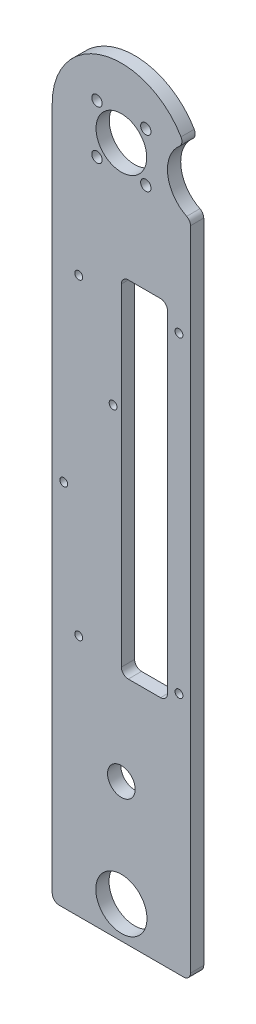
ISO-10303-21;
HEADER;
FILE_DESCRIPTION(('STEP AP214'),'2;1');
FILE_NAME('part.step','',(''),(''),'','','');
FILE_SCHEMA(('AUTOMOTIVE_DESIGN { 1 0 10303 214 1 1 1 1 }'));
ENDSEC;
DATA;
#1=APPLICATION_CONTEXT('core data for automotive mechanical design processes');
#2=APPLICATION_PROTOCOL_DEFINITION('international standard','automotive_design',2000,#1);
#3=PRODUCT_CONTEXT('',#1,'mechanical');
#4=PRODUCT('Part','Part','',(#3));
#5=PRODUCT_RELATED_PRODUCT_CATEGORY('part','',(#4));
#6=PRODUCT_DEFINITION_FORMATION('','',#4);
#7=PRODUCT_DEFINITION_CONTEXT('part definition',#1,'design');
#8=PRODUCT_DEFINITION('design','',#6,#7);
#9=PRODUCT_DEFINITION_SHAPE('','',#8);
#10=(LENGTH_UNIT() NAMED_UNIT(*) SI_UNIT(.MILLI.,.METRE.));
#11=(NAMED_UNIT(*) PLANE_ANGLE_UNIT() SI_UNIT($,.RADIAN.));
#12=(NAMED_UNIT(*) SI_UNIT($,.STERADIAN.) SOLID_ANGLE_UNIT());
#13=UNCERTAINTY_MEASURE_WITH_UNIT(LENGTH_MEASURE(1.E-05),#10,'distance_accuracy_value','');
#14=(GEOMETRIC_REPRESENTATION_CONTEXT(3) GLOBAL_UNCERTAINTY_ASSIGNED_CONTEXT((#13)) GLOBAL_UNIT_ASSIGNED_CONTEXT((#10,
#11,#12)) REPRESENTATION_CONTEXT('',''));
#15=CARTESIAN_POINT('',(0.,0.,0.));
#16=DIRECTION('',(0.,0.,1.));
#17=DIRECTION('',(1.,0.,0.));
#18=AXIS2_PLACEMENT_3D('',#15,#16,#17);
#19=CARTESIAN_POINT('',(60.,0.,5.74999999999996));
#20=DIRECTION('',(0.,0.,-1.));
#21=DIRECTION('',(0.,1.,0.));
#22=AXIS2_PLACEMENT_3D('',#19,#20,#21);
#23=PLANE('',#22);
#24=CARTESIAN_POINT('',(11.50000102,240.99999992,5.74999999999998));
#25=DIRECTION('',(0.,0.,-1.));
#26=DIRECTION('',(0.,1.,0.));
#27=AXIS2_PLACEMENT_3D('',#24,#25,#26);
#28=CIRCLE('',#27,1.7);
#29=CARTESIAN_POINT('',(11.50000102,242.69999992,5.74999999999998));
#30=VERTEX_POINT('',#29);
#31=EDGE_CURVE('E580',#30,#30,#28,.T.);
#32=ORIENTED_EDGE('',*,*,#31,.T.);
#33=EDGE_LOOP('',(#32));
#34=FACE_BOUND('',#33,.T.);
#35=CARTESIAN_POINT('',(55.00000038,240.99999992,5.74999999999998));
#36=DIRECTION('',(0.,0.,-1.));
#37=DIRECTION('',(0.,1.,0.));
#38=AXIS2_PLACEMENT_3D('',#35,#36,#37);
#39=CIRCLE('',#38,1.7);
#40=CARTESIAN_POINT('',(55.00000038,242.69999992,5.74999999999998));
#41=VERTEX_POINT('',#40);
#42=EDGE_CURVE('E593',#41,#41,#39,.T.);
#43=ORIENTED_EDGE('',*,*,#42,.T.);
#44=EDGE_LOOP('',(#43));
#45=FACE_BOUND('',#44,.T.);
#46=CARTESIAN_POINT('',(11.50000102,105.49999914,5.74999999999997));
#47=DIRECTION('',(0.,0.,-1.));
#48=DIRECTION('',(0.,1.,0.));
#49=AXIS2_PLACEMENT_3D('',#46,#47,#48);
#50=CIRCLE('',#49,1.7);
#51=CARTESIAN_POINT('',(11.50000102,107.19999914,5.74999999999997));
#52=VERTEX_POINT('',#51);
#53=EDGE_CURVE('E601',#52,#52,#50,.T.);
#54=ORIENTED_EDGE('',*,*,#53,.T.);
#55=EDGE_LOOP('',(#54));
#56=FACE_BOUND('',#55,.T.);
#57=CARTESIAN_POINT('',(55.00000038,105.49999914,5.74999999999997));
#58=DIRECTION('',(0.,0.,-1.));
#59=DIRECTION('',(0.,1.,0.));
#60=AXIS2_PLACEMENT_3D('',#57,#58,#59);
#61=CIRCLE('',#60,1.7);
#62=CARTESIAN_POINT('',(55.00000038,107.19999914,5.74999999999997));
#63=VERTEX_POINT('',#62);
#64=EDGE_CURVE('E609',#63,#63,#61,.T.);
#65=ORIENTED_EDGE('',*,*,#64,.T.);
#66=EDGE_LOOP('',(#65));
#67=FACE_BOUND('',#66,.T.);
#68=CARTESIAN_POINT('',(5.,160.,5.74999999999997));
#69=DIRECTION('',(0.,0.,-1.));
#70=DIRECTION('',(0.,1.,0.));
#71=AXIS2_PLACEMENT_3D('',#68,#69,#70);
#72=CIRCLE('',#71,1.7);
#73=CARTESIAN_POINT('',(5.,161.7,5.74999999999997));
#74=VERTEX_POINT('',#73);
#75=EDGE_CURVE('E617',#74,#74,#72,.T.);
#76=ORIENTED_EDGE('',*,*,#75,.T.);
#77=EDGE_LOOP('',(#76));
#78=FACE_BOUND('',#77,.T.);
#79=CARTESIAN_POINT('',(26.4,199.7,5.74999999999997));
#80=DIRECTION('',(0.,0.,-1.));
#81=DIRECTION('',(0.,1.,0.));
#82=AXIS2_PLACEMENT_3D('',#79,#80,#81);
#83=CIRCLE('',#82,1.7);
#84=CARTESIAN_POINT('',(26.4,201.4,5.74999999999997));
#85=VERTEX_POINT('',#84);
#86=EDGE_CURVE('E625',#85,#85,#83,.T.);
#87=ORIENTED_EDGE('',*,*,#86,.T.);
#88=EDGE_LOOP('',(#87));
#89=FACE_BOUND('',#88,.T.);
#90=CARTESIAN_POINT('',(30.,60.,5.74999999999995));
#91=DIRECTION('',(0.,0.,-1.));
#92=DIRECTION('',(0.,1.,0.));
#93=AXIS2_PLACEMENT_3D('',#90,#91,#92);
#94=CIRCLE('',#93,6.);
#95=CARTESIAN_POINT('',(30.,66.,5.74999999999995));
#96=VERTEX_POINT('',#95);
#97=EDGE_CURVE('E472',#96,#96,#94,.F.);
#98=ORIENTED_EDGE('',*,*,#97,.F.);
#99=EDGE_LOOP('',(#98));
#100=FACE_BOUND('',#99,.T.);
#101=DIRECTION('',(-1.,0.,0.));
#102=VECTOR('',#101,1.);
#103=CARTESIAN_POINT('',(50.0000000000001,250.,5.74999999999995));
#104=LINE('',#103,#102);
#105=CARTESIAN_POINT('',(47.0000000000001,250.,5.74999999999995));
#106=VERTEX_POINT('',#105);
#107=CARTESIAN_POINT('',(33.0000000000001,250.,5.74999999999995));
#108=VERTEX_POINT('',#107);
#109=EDGE_CURVE('E371',#106,#108,#104,.T.);
#110=ORIENTED_EDGE('',*,*,#109,.F.);
#111=CARTESIAN_POINT('',(47.0000000000001,247.,5.74999999999995));
#112=DIRECTION('',(0.,0.,-1.));
#113=DIRECTION('',(0.,1.,0.));
#114=AXIS2_PLACEMENT_3D('',#111,#112,#113);
#115=CIRCLE('',#114,3.);
#116=CARTESIAN_POINT('',(50.0000000000001,247.,5.74999999999995));
#117=VERTEX_POINT('',#116);
#118=EDGE_CURVE('E341',#106,#117,#115,.T.);
#119=ORIENTED_EDGE('',*,*,#118,.T.);
#120=DIRECTION('',(0.,1.,0.));
#121=VECTOR('',#120,1.);
#122=CARTESIAN_POINT('',(50.0000000000001,250.,5.74999999999995));
#123=LINE('',#122,#121);
#124=CARTESIAN_POINT('',(50.,103.,5.74999999999995));
#125=VERTEX_POINT('',#124);
#126=EDGE_CURVE('E378',#125,#117,#123,.T.);
#127=ORIENTED_EDGE('',*,*,#126,.F.);
#128=CARTESIAN_POINT('',(47.,103.,5.74999999999995));
#129=DIRECTION('',(0.,0.,-1.));
#130=DIRECTION('',(0.,1.,0.));
#131=AXIS2_PLACEMENT_3D('',#128,#129,#130);
#132=CIRCLE('',#131,3.);
#133=CARTESIAN_POINT('',(47.,100.,5.74999999999995));
#134=VERTEX_POINT('',#133);
#135=EDGE_CURVE('E335',#125,#134,#132,.T.);
#136=ORIENTED_EDGE('',*,*,#135,.T.);
#137=DIRECTION('',(1.,0.,0.));
#138=VECTOR('',#137,1.);
#139=CARTESIAN_POINT('',(50.,100.,5.74999999999995));
#140=LINE('',#139,#138);
#141=CARTESIAN_POINT('',(33.,100.,5.74999999999995));
#142=VERTEX_POINT('',#141);
#143=EDGE_CURVE('E383',#142,#134,#140,.T.);
#144=ORIENTED_EDGE('',*,*,#143,.F.);
#145=CARTESIAN_POINT('',(33.,103.,5.74999999999995));
#146=DIRECTION('',(0.,0.,-1.));
#147=DIRECTION('',(0.,1.,0.));
#148=AXIS2_PLACEMENT_3D('',#145,#146,#147);
#149=CIRCLE('',#148,3.);
#150=CARTESIAN_POINT('',(30.,103.,5.74999999999995));
#151=VERTEX_POINT('',#150);
#152=EDGE_CURVE('E329',#142,#151,#149,.T.);
#153=ORIENTED_EDGE('',*,*,#152,.T.);
#154=DIRECTION('',(0.,-1.,0.));
#155=VECTOR('',#154,1.);
#156=CARTESIAN_POINT('',(30.0000000000001,250.,5.74999999999995));
#157=LINE('',#156,#155);
#158=CARTESIAN_POINT('',(30.0000000000001,247.,5.74999999999995));
#159=VERTEX_POINT('',#158);
#160=EDGE_CURVE('E373',#159,#151,#157,.T.);
#161=ORIENTED_EDGE('',*,*,#160,.F.);
#162=CARTESIAN_POINT('',(33.0000000000001,247.,5.74999999999995));
#163=DIRECTION('',(0.,0.,-1.));
#164=DIRECTION('',(0.,1.,0.));
#165=AXIS2_PLACEMENT_3D('',#162,#163,#164);
#166=CIRCLE('',#165,3.);
#167=EDGE_CURVE('E12',#159,#108,#166,.T.);
#168=ORIENTED_EDGE('',*,*,#167,.T.);
#169=EDGE_LOOP('',(#110,#119,#127,#136,#144,#153,#161,#168));
#170=FACE_BOUND('',#169,.T.);
#171=CARTESIAN_POINT('',(30.,14.,5.74999999999996));
#172=DIRECTION('',(0.,0.,-1.));
#173=DIRECTION('',(0.,1.,0.));
#174=AXIS2_PLACEMENT_3D('',#171,#172,#173);
#175=CIRCLE('',#174,11.1125);
#176=CARTESIAN_POINT('',(30.,25.1125,5.74999999999996));
#177=VERTEX_POINT('',#176);
#178=EDGE_CURVE('E405',#177,#177,#175,.F.);
#179=ORIENTED_EDGE('',*,*,#178,.F.);
#180=EDGE_LOOP('',(#179));
#181=FACE_BOUND('',#180,.T.);
#182=CARTESIAN_POINT('',(19.3933982822018,310.606601717798,5.74999999999996));
#183=DIRECTION('',(0.,0.,1.));
#184=DIRECTION('',(1.,0.,0.));
#185=AXIS2_PLACEMENT_3D('',#182,#183,#184);
#186=CIRCLE('',#185,2.25);
#187=CARTESIAN_POINT('',(21.6433982822018,310.606601717798,5.74999999999996));
#188=VERTEX_POINT('',#187);
#189=EDGE_CURVE('E409',#188,#188,#186,.T.);
#190=ORIENTED_EDGE('',*,*,#189,.F.);
#191=EDGE_LOOP('',(#190));
#192=FACE_BOUND('',#191,.T.);
#193=CARTESIAN_POINT('',(40.6066017177982,289.393398282202,5.74999999999996));
#194=DIRECTION('',(0.,0.,1.));
#195=DIRECTION('',(1.,0.,0.));
#196=AXIS2_PLACEMENT_3D('',#193,#194,#195);
#197=CIRCLE('',#196,2.25);
#198=CARTESIAN_POINT('',(42.8566017177982,289.393398282202,5.74999999999996));
#199=VERTEX_POINT('',#198);
#200=EDGE_CURVE('E425',#199,#199,#197,.T.);
#201=ORIENTED_EDGE('',*,*,#200,.F.);
#202=EDGE_LOOP('',(#201));
#203=FACE_BOUND('',#202,.T.);
#204=CARTESIAN_POINT('',(19.3933982822018,289.393398282202,5.74999999999996));
#205=DIRECTION('',(0.,0.,1.));
#206=DIRECTION('',(1.,0.,0.));
#207=AXIS2_PLACEMENT_3D('',#204,#205,#206);
#208=CIRCLE('',#207,2.25);
#209=CARTESIAN_POINT('',(21.6433982822018,289.393398282202,5.74999999999996));
#210=VERTEX_POINT('',#209);
#211=EDGE_CURVE('E433',#210,#210,#208,.T.);
#212=ORIENTED_EDGE('',*,*,#211,.F.);
#213=EDGE_LOOP('',(#212));
#214=FACE_BOUND('',#213,.T.);
#215=CARTESIAN_POINT('',(30.,300.,5.74999999999996));
#216=DIRECTION('',(0.,0.,1.));
#217=DIRECTION('',(1.,0.,0.));
#218=AXIS2_PLACEMENT_3D('',#215,#216,#217);
#219=CIRCLE('',#218,11.);
#220=CARTESIAN_POINT('',(41.,300.,5.74999999999996));
#221=VERTEX_POINT('',#220);
#222=EDGE_CURVE('E215',#221,#221,#219,.T.);
#223=ORIENTED_EDGE('',*,*,#222,.F.);
#224=EDGE_LOOP('',(#223));
#225=FACE_BOUND('',#224,.T.);
#226=DIRECTION('',(0.,-1.,0.));
#227=VECTOR('',#226,1.);
#228=CARTESIAN_POINT('',(60.,0.,5.74999999999996));
#229=LINE('',#228,#227);
#230=CARTESIAN_POINT('',(60.,283.875484503403,5.74999999999996));
#231=VERTEX_POINT('',#230);
#232=CARTESIAN_POINT('',(60.,3.,5.74999999999996));
#233=VERTEX_POINT('',#232);
#234=EDGE_CURVE('E238',#231,#233,#229,.T.);
#235=ORIENTED_EDGE('',*,*,#234,.F.);
#236=CARTESIAN_POINT('',(57.,283.875484503403,5.74999999999995));
#237=DIRECTION('',(0.,0.,-1.));
#238=DIRECTION('',(0.,1.,0.));
#239=AXIS2_PLACEMENT_3D('',#236,#237,#238);
#240=CIRCLE('',#239,3.);
#241=CARTESIAN_POINT('',(58.3333333333333,286.562903752836,5.74999999999995));
#242=VERTEX_POINT('',#241);
#243=EDGE_CURVE('E284',#231,#242,#240,.F.);
#244=ORIENTED_EDGE('',*,*,#243,.T.);
#245=CARTESIAN_POINT('',(65.,300.,5.74999999999995));
#246=DIRECTION('',(0.,0.,-1.));
#247=DIRECTION('',(0.,1.,0.));
#248=AXIS2_PLACEMENT_3D('',#245,#246,#247);
#249=CIRCLE('',#248,15.);
#250=CARTESIAN_POINT('',(55.2380952380952,311.388819755335,5.74999999999995));
#251=VERTEX_POINT('',#250);
#252=EDGE_CURVE('E392',#251,#242,#249,.F.);
#253=ORIENTED_EDGE('',*,*,#252,.F.);
#254=CARTESIAN_POINT('',(53.2857142857142,313.666583706402,5.74999999999995));
#255=DIRECTION('',(0.,0.,-1.));
#256=DIRECTION('',(0.,1.,0.));
#257=AXIS2_PLACEMENT_3D('',#254,#255,#256);
#258=CIRCLE('',#257,3.);
#259=CARTESIAN_POINT('',(55.8730158730158,315.185093007113,5.74999999999996));
#260=VERTEX_POINT('',#259);
#261=EDGE_CURVE('E210',#251,#260,#258,.F.);
#262=ORIENTED_EDGE('',*,*,#261,.T.);
#263=CARTESIAN_POINT('',(30.,300.,5.74999999999996));
#264=DIRECTION('',(0.,0.,1.));
#265=DIRECTION('',(1.,0.,0.));
#266=AXIS2_PLACEMENT_3D('',#263,#264,#265);
#267=CIRCLE('',#266,30.);
#268=CARTESIAN_POINT('',(0.,300.,5.74999999999996));
#269=VERTEX_POINT('',#268);
#270=EDGE_CURVE('E202',#260,#269,#267,.T.);
#271=ORIENTED_EDGE('',*,*,#270,.T.);
#272=DIRECTION('',(0.,-1.,0.));
#273=VECTOR('',#272,1.);
#274=CARTESIAN_POINT('',(0.,0.,5.74999999999996));
#275=LINE('',#274,#273);
#276=CARTESIAN_POINT('',(0.,3.,5.74999999999996));
#277=VERTEX_POINT('',#276);
#278=EDGE_CURVE('E207',#269,#277,#275,.T.);
#279=ORIENTED_EDGE('',*,*,#278,.T.);
#280=CARTESIAN_POINT('',(3.,3.,5.74999999999996));
#281=DIRECTION('',(0.,0.,-1.));
#282=DIRECTION('',(0.,1.,0.));
#283=AXIS2_PLACEMENT_3D('',#280,#281,#282);
#284=CIRCLE('',#283,3.);
#285=CARTESIAN_POINT('',(3.,0.,5.74999999999996));
#286=VERTEX_POINT('',#285);
#287=EDGE_CURVE('E99',#277,#286,#284,.F.);
#288=ORIENTED_EDGE('',*,*,#287,.T.);
#289=DIRECTION('',(-1.,0.,0.));
#290=VECTOR('',#289,1.);
#291=CARTESIAN_POINT('',(60.,0.,5.74999999999996));
#292=LINE('',#291,#290);
#293=CARTESIAN_POINT('',(57.,0.,5.74999999999996));
#294=VERTEX_POINT('',#293);
#295=EDGE_CURVE('E244',#294,#286,#292,.T.);
#296=ORIENTED_EDGE('',*,*,#295,.F.);
#297=CARTESIAN_POINT('',(57.,3.,5.74999999999996));
#298=DIRECTION('',(0.,0.,-1.));
#299=DIRECTION('',(0.,1.,0.));
#300=AXIS2_PLACEMENT_3D('',#297,#298,#299);
#301=CIRCLE('',#300,3.);
#302=EDGE_CURVE('E279',#294,#233,#301,.F.);
#303=ORIENTED_EDGE('',*,*,#302,.T.);
#304=EDGE_LOOP('',(#235,#244,#253,#262,#271,#279,#288,#296,#303));
#305=FACE_BOUND('',#304,.T.);
#306=CARTESIAN_POINT('',(40.6066017177982,310.606601717798,5.74999999999996));
#307=DIRECTION('',(0.,0.,1.));
#308=DIRECTION('',(1.,0.,0.));
#309=AXIS2_PLACEMENT_3D('',#306,#307,#308);
#310=CIRCLE('',#309,2.25);
#311=CARTESIAN_POINT('',(42.8566017177982,310.606601717798,5.74999999999996));
#312=VERTEX_POINT('',#311);
#313=EDGE_CURVE('E417',#312,#312,#310,.T.);
#314=ORIENTED_EDGE('',*,*,#313,.F.);
#315=EDGE_LOOP('',(#314));
#316=FACE_BOUND('',#315,.T.);
#317=ADVANCED_FACE('F83',(#34,#45,#56,#67,#78,#89,#100,#170,#181,#192,#203,#214,#225,#305,#316),
#23,.F.);
#318=CARTESIAN_POINT('',(60.,330.,0.));
#319=DIRECTION('',(0.,0.,1.));
#320=DIRECTION('',(0.,-1.,0.));
#321=AXIS2_PLACEMENT_3D('',#318,#319,#320);
#322=PLANE('',#321);
#323=CARTESIAN_POINT('',(11.50000102,240.99999992,0.));
#324=DIRECTION('',(0.,0.,-1.));
#325=DIRECTION('',(0.,1.,0.));
#326=AXIS2_PLACEMENT_3D('',#323,#324,#325);
#327=CIRCLE('',#326,1.7);
#328=CARTESIAN_POINT('',(11.50000102,242.69999992,0.));
#329=VERTEX_POINT('',#328);
#330=EDGE_CURVE('E583',#329,#329,#327,.T.);
#331=ORIENTED_EDGE('',*,*,#330,.F.);
#332=EDGE_LOOP('',(#331));
#333=FACE_BOUND('',#332,.T.);
#334=CARTESIAN_POINT('',(55.00000038,240.99999992,0.));
#335=DIRECTION('',(0.,0.,-1.));
#336=DIRECTION('',(0.,1.,0.));
#337=AXIS2_PLACEMENT_3D('',#334,#335,#336);
#338=CIRCLE('',#337,1.7);
#339=CARTESIAN_POINT('',(55.00000038,242.69999992,0.));
#340=VERTEX_POINT('',#339);
#341=EDGE_CURVE('E587',#340,#340,#338,.T.);
#342=ORIENTED_EDGE('',*,*,#341,.F.);
#343=EDGE_LOOP('',(#342));
#344=FACE_BOUND('',#343,.T.);
#345=CARTESIAN_POINT('',(11.50000102,105.49999914,0.));
#346=DIRECTION('',(0.,0.,-1.));
#347=DIRECTION('',(0.,1.,0.));
#348=AXIS2_PLACEMENT_3D('',#345,#346,#347);
#349=CIRCLE('',#348,1.7);
#350=CARTESIAN_POINT('',(11.50000102,107.19999914,0.));
#351=VERTEX_POINT('',#350);
#352=EDGE_CURVE('E597',#351,#351,#349,.T.);
#353=ORIENTED_EDGE('',*,*,#352,.F.);
#354=EDGE_LOOP('',(#353));
#355=FACE_BOUND('',#354,.T.);
#356=CARTESIAN_POINT('',(55.00000038,105.49999914,0.));
#357=DIRECTION('',(0.,0.,-1.));
#358=DIRECTION('',(0.,1.,0.));
#359=AXIS2_PLACEMENT_3D('',#356,#357,#358);
#360=CIRCLE('',#359,1.7);
#361=CARTESIAN_POINT('',(55.00000038,107.19999914,0.));
#362=VERTEX_POINT('',#361);
#363=EDGE_CURVE('E605',#362,#362,#360,.T.);
#364=ORIENTED_EDGE('',*,*,#363,.F.);
#365=EDGE_LOOP('',(#364));
#366=FACE_BOUND('',#365,.T.);
#367=CARTESIAN_POINT('',(5.,160.,0.));
#368=DIRECTION('',(0.,0.,-1.));
#369=DIRECTION('',(0.,1.,0.));
#370=AXIS2_PLACEMENT_3D('',#367,#368,#369);
#371=CIRCLE('',#370,1.7);
#372=CARTESIAN_POINT('',(5.,161.7,0.));
#373=VERTEX_POINT('',#372);
#374=EDGE_CURVE('E613',#373,#373,#371,.T.);
#375=ORIENTED_EDGE('',*,*,#374,.F.);
#376=EDGE_LOOP('',(#375));
#377=FACE_BOUND('',#376,.T.);
#378=CARTESIAN_POINT('',(26.4,199.7,0.));
#379=DIRECTION('',(0.,0.,-1.));
#380=DIRECTION('',(0.,1.,0.));
#381=AXIS2_PLACEMENT_3D('',#378,#379,#380);
#382=CIRCLE('',#381,1.7);
#383=CARTESIAN_POINT('',(26.4,201.4,0.));
#384=VERTEX_POINT('',#383);
#385=EDGE_CURVE('E621',#384,#384,#382,.T.);
#386=ORIENTED_EDGE('',*,*,#385,.F.);
#387=EDGE_LOOP('',(#386));
#388=FACE_BOUND('',#387,.T.);
#389=CARTESIAN_POINT('',(30.,60.,0.));
#390=DIRECTION('',(0.,0.,-1.));
#391=DIRECTION('',(0.,1.,0.));
#392=AXIS2_PLACEMENT_3D('',#389,#390,#391);
#393=CIRCLE('',#392,6.);
#394=CARTESIAN_POINT('',(30.,66.,0.));
#395=VERTEX_POINT('',#394);
#396=EDGE_CURVE('E629',#395,#395,#393,.T.);
#397=ORIENTED_EDGE('',*,*,#396,.F.);
#398=EDGE_LOOP('',(#397));
#399=FACE_BOUND('',#398,.T.);
#400=DIRECTION('',(-1.,0.,0.));
#401=VECTOR('',#400,1.);
#402=CARTESIAN_POINT('',(50.,100.,0.));
#403=LINE('',#402,#401);
#404=CARTESIAN_POINT('',(47.,100.,0.));
#405=VERTEX_POINT('',#404);
#406=CARTESIAN_POINT('',(33.,100.,0.));
#407=VERTEX_POINT('',#406);
#408=EDGE_CURVE('E363',#405,#407,#403,.T.);
#409=ORIENTED_EDGE('',*,*,#408,.F.);
#410=CARTESIAN_POINT('',(47.,103.,0.));
#411=DIRECTION('',(0.,0.,1.));
#412=DIRECTION('',(0.,-1.,0.));
#413=AXIS2_PLACEMENT_3D('',#410,#411,#412);
#414=CIRCLE('',#413,3.);
#415=CARTESIAN_POINT('',(50.,103.,0.));
#416=VERTEX_POINT('',#415);
#417=EDGE_CURVE('E332',#405,#416,#414,.T.);
#418=ORIENTED_EDGE('',*,*,#417,.T.);
#419=DIRECTION('',(0.,-1.,0.));
#420=VECTOR('',#419,1.);
#421=CARTESIAN_POINT('',(50.0000000000001,250.,0.));
#422=LINE('',#421,#420);
#423=CARTESIAN_POINT('',(50.0000000000001,247.,0.));
#424=VERTEX_POINT('',#423);
#425=EDGE_CURVE('E388',#424,#416,#422,.T.);
#426=ORIENTED_EDGE('',*,*,#425,.F.);
#427=CARTESIAN_POINT('',(47.0000000000001,247.,0.));
#428=DIRECTION('',(0.,0.,1.));
#429=DIRECTION('',(0.,-1.,0.));
#430=AXIS2_PLACEMENT_3D('',#427,#428,#429);
#431=CIRCLE('',#430,3.);
#432=CARTESIAN_POINT('',(47.0000000000001,250.,0.));
#433=VERTEX_POINT('',#432);
#434=EDGE_CURVE('E338',#424,#433,#431,.T.);
#435=ORIENTED_EDGE('',*,*,#434,.T.);
#436=DIRECTION('',(1.,0.,0.));
#437=VECTOR('',#436,1.);
#438=CARTESIAN_POINT('',(50.0000000000001,250.,0.));
#439=LINE('',#438,#437);
#440=CARTESIAN_POINT('',(33.0000000000001,250.,0.));
#441=VERTEX_POINT('',#440);
#442=EDGE_CURVE('E353',#441,#433,#439,.T.);
#443=ORIENTED_EDGE('',*,*,#442,.F.);
#444=CARTESIAN_POINT('',(33.0000000000001,247.,0.));
#445=DIRECTION('',(0.,0.,1.));
#446=DIRECTION('',(0.,-1.,0.));
#447=AXIS2_PLACEMENT_3D('',#444,#445,#446);
#448=CIRCLE('',#447,3.);
#449=CARTESIAN_POINT('',(30.0000000000001,247.,0.));
#450=VERTEX_POINT('',#449);
#451=EDGE_CURVE('E92',#441,#450,#448,.T.);
#452=ORIENTED_EDGE('',*,*,#451,.T.);
#453=DIRECTION('',(0.,1.,0.));
#454=VECTOR('',#453,1.);
#455=CARTESIAN_POINT('',(30.0000000000001,250.,0.));
#456=LINE('',#455,#454);
#457=CARTESIAN_POINT('',(30.,103.,0.));
#458=VERTEX_POINT('',#457);
#459=EDGE_CURVE('E351',#458,#450,#456,.T.);
#460=ORIENTED_EDGE('',*,*,#459,.F.);
#461=CARTESIAN_POINT('',(33.,103.,0.));
#462=DIRECTION('',(0.,0.,1.));
#463=DIRECTION('',(0.,-1.,0.));
#464=AXIS2_PLACEMENT_3D('',#461,#462,#463);
#465=CIRCLE('',#464,3.);
#466=EDGE_CURVE('E326',#458,#407,#465,.T.);
#467=ORIENTED_EDGE('',*,*,#466,.T.);
#468=EDGE_LOOP('',(#409,#418,#426,#435,#443,#452,#460,#467));
#469=FACE_BOUND('',#468,.T.);
#470=CARTESIAN_POINT('',(30.,14.,0.));
#471=DIRECTION('',(0.,0.,-1.));
#472=DIRECTION('',(0.,1.,0.));
#473=AXIS2_PLACEMENT_3D('',#470,#471,#472);
#474=CIRCLE('',#473,11.1125);
#475=CARTESIAN_POINT('',(30.,25.1125,0.));
#476=VERTEX_POINT('',#475);
#477=EDGE_CURVE('E401',#476,#476,#474,.T.);
#478=ORIENTED_EDGE('',*,*,#477,.F.);
#479=EDGE_LOOP('',(#478));
#480=FACE_BOUND('',#479,.T.);
#481=CARTESIAN_POINT('',(19.3933982822018,310.606601717798,0.));
#482=DIRECTION('',(0.,0.,1.));
#483=DIRECTION('',(0.,-1.,0.));
#484=AXIS2_PLACEMENT_3D('',#481,#482,#483);
#485=CIRCLE('',#484,2.25);
#486=CARTESIAN_POINT('',(19.3933982822018,308.356601717798,0.));
#487=VERTEX_POINT('',#486);
#488=EDGE_CURVE('E413',#487,#487,#485,.T.);
#489=ORIENTED_EDGE('',*,*,#488,.T.);
#490=EDGE_LOOP('',(#489));
#491=FACE_BOUND('',#490,.T.);
#492=CARTESIAN_POINT('',(40.6066017177982,310.606601717798,0.));
#493=DIRECTION('',(0.,0.,1.));
#494=DIRECTION('',(0.,-1.,0.));
#495=AXIS2_PLACEMENT_3D('',#492,#493,#494);
#496=CIRCLE('',#495,2.25);
#497=CARTESIAN_POINT('',(40.6066017177982,308.356601717798,0.));
#498=VERTEX_POINT('',#497);
#499=EDGE_CURVE('E421',#498,#498,#496,.T.);
#500=ORIENTED_EDGE('',*,*,#499,.T.);
#501=EDGE_LOOP('',(#500));
#502=FACE_BOUND('',#501,.T.);
#503=CARTESIAN_POINT('',(40.6066017177982,289.393398282202,0.));
#504=DIRECTION('',(0.,0.,1.));
#505=DIRECTION('',(0.,-1.,0.));
#506=AXIS2_PLACEMENT_3D('',#503,#504,#505);
#507=CIRCLE('',#506,2.25);
#508=CARTESIAN_POINT('',(40.6066017177982,287.143398282202,0.));
#509=VERTEX_POINT('',#508);
#510=EDGE_CURVE('E429',#509,#509,#507,.T.);
#511=ORIENTED_EDGE('',*,*,#510,.T.);
#512=EDGE_LOOP('',(#511));
#513=FACE_BOUND('',#512,.T.);
#514=CARTESIAN_POINT('',(19.3933982822018,289.393398282202,0.));
#515=DIRECTION('',(0.,0.,1.));
#516=DIRECTION('',(0.,-1.,0.));
#517=AXIS2_PLACEMENT_3D('',#514,#515,#516);
#518=CIRCLE('',#517,2.25);
#519=CARTESIAN_POINT('',(19.3933982822018,287.143398282202,0.));
#520=VERTEX_POINT('',#519);
#521=EDGE_CURVE('E226',#520,#520,#518,.T.);
#522=ORIENTED_EDGE('',*,*,#521,.T.);
#523=EDGE_LOOP('',(#522));
#524=FACE_BOUND('',#523,.T.);
#525=CARTESIAN_POINT('',(30.,300.,0.));
#526=DIRECTION('',(0.,0.,1.));
#527=DIRECTION('',(0.,-1.,0.));
#528=AXIS2_PLACEMENT_3D('',#525,#526,#527);
#529=CIRCLE('',#528,11.);
#530=CARTESIAN_POINT('',(30.,289.,0.));
#531=VERTEX_POINT('',#530);
#532=EDGE_CURVE('E240',#531,#531,#529,.F.);
#533=ORIENTED_EDGE('',*,*,#532,.F.);
#534=EDGE_LOOP('',(#533));
#535=FACE_BOUND('',#534,.T.);
#536=CARTESIAN_POINT('',(65.,300.,0.));
#537=DIRECTION('',(0.,0.,-1.));
#538=DIRECTION('',(0.,1.,0.));
#539=AXIS2_PLACEMENT_3D('',#536,#537,#538);
#540=CIRCLE('',#539,15.);
#541=CARTESIAN_POINT('',(58.3333333333333,286.562903752836,0.));
#542=VERTEX_POINT('',#541);
#543=CARTESIAN_POINT('',(55.2380952380952,311.388819755335,0.));
#544=VERTEX_POINT('',#543);
#545=EDGE_CURVE('E464',#542,#544,#540,.T.);
#546=ORIENTED_EDGE('',*,*,#545,.F.);
#547=CARTESIAN_POINT('',(57.,283.875484503403,0.));
#548=DIRECTION('',(0.,0.,1.));
#549=DIRECTION('',(0.,-1.,0.));
#550=AXIS2_PLACEMENT_3D('',#547,#548,#549);
#551=CIRCLE('',#550,3.);
#552=CARTESIAN_POINT('',(60.,283.875484503403,0.));
#553=VERTEX_POINT('',#552);
#554=EDGE_CURVE('E267',#542,#553,#551,.F.);
#555=ORIENTED_EDGE('',*,*,#554,.T.);
#556=DIRECTION('',(0.,1.,0.));
#557=VECTOR('',#556,1.);
#558=CARTESIAN_POINT('',(60.,330.,0.));
#559=LINE('',#558,#557);
#560=CARTESIAN_POINT('',(60.,3.,0.));
#561=VERTEX_POINT('',#560);
#562=EDGE_CURVE('E232',#561,#553,#559,.T.);
#563=ORIENTED_EDGE('',*,*,#562,.F.);
#564=CARTESIAN_POINT('',(57.,3.,0.));
#565=DIRECTION('',(0.,0.,1.));
#566=DIRECTION('',(0.,-1.,0.));
#567=AXIS2_PLACEMENT_3D('',#564,#565,#566);
#568=CIRCLE('',#567,3.);
#569=CARTESIAN_POINT('',(57.,0.,0.));
#570=VERTEX_POINT('',#569);
#571=EDGE_CURVE('E261',#561,#570,#568,.F.);
#572=ORIENTED_EDGE('',*,*,#571,.T.);
#573=DIRECTION('',(-1.,0.,0.));
#574=VECTOR('',#573,1.);
#575=CARTESIAN_POINT('',(60.,0.,0.));
#576=LINE('',#575,#574);
#577=CARTESIAN_POINT('',(3.,0.,0.));
#578=VERTEX_POINT('',#577);
#579=EDGE_CURVE('E247',#570,#578,#576,.T.);
#580=ORIENTED_EDGE('',*,*,#579,.T.);
#581=CARTESIAN_POINT('',(3.,3.,0.));
#582=DIRECTION('',(0.,0.,1.));
#583=DIRECTION('',(0.,-1.,0.));
#584=AXIS2_PLACEMENT_3D('',#581,#582,#583);
#585=CIRCLE('',#584,3.);
#586=CARTESIAN_POINT('',(0.,3.,0.));
#587=VERTEX_POINT('',#586);
#588=EDGE_CURVE('E258',#578,#587,#585,.F.);
#589=ORIENTED_EDGE('',*,*,#588,.T.);
#590=DIRECTION('',(0.,1.,0.));
#591=VECTOR('',#590,1.);
#592=CARTESIAN_POINT('',(0.,330.,0.));
#593=LINE('',#592,#591);
#594=CARTESIAN_POINT('',(0.,300.,0.));
#595=VERTEX_POINT('',#594);
#596=EDGE_CURVE('E233',#587,#595,#593,.T.);
#597=ORIENTED_EDGE('',*,*,#596,.T.);
#598=CARTESIAN_POINT('',(30.,300.,0.));
#599=DIRECTION('',(0.,0.,1.));
#600=DIRECTION('',(0.,-1.,0.));
#601=AXIS2_PLACEMENT_3D('',#598,#599,#600);
#602=CIRCLE('',#601,30.);
#603=CARTESIAN_POINT('',(55.8730158730158,315.185093007113,0.));
#604=VERTEX_POINT('',#603);
#605=EDGE_CURVE('E216',#595,#604,#602,.F.);
#606=ORIENTED_EDGE('',*,*,#605,.T.);
#607=CARTESIAN_POINT('',(53.2857142857142,313.666583706402,0.));
#608=DIRECTION('',(0.,0.,1.));
#609=DIRECTION('',(0.,-1.,0.));
#610=AXIS2_PLACEMENT_3D('',#607,#608,#609);
#611=CIRCLE('',#610,3.);
#612=EDGE_CURVE('E264',#604,#544,#611,.F.);
#613=ORIENTED_EDGE('',*,*,#612,.T.);
#614=EDGE_LOOP('',(#546,#555,#563,#572,#580,#589,#597,#606,#613));
#615=FACE_BOUND('',#614,.T.);
#616=ADVANCED_FACE('F349',(#333,#344,#355,#366,#377,#388,#399,#469,#480,#491,#502,#513,#524,
#535,#615),#322,.F.);
#617=CARTESIAN_POINT('',(60.,0.,0.));
#618=DIRECTION('',(0.,1.,0.));
#619=DIRECTION('',(0.,0.,1.));
#620=AXIS2_PLACEMENT_3D('',#617,#618,#619);
#621=PLANE('',#620);
#622=ORIENTED_EDGE('',*,*,#579,.F.);
#623=DIRECTION('',(0.,0.,-1.));
#624=VECTOR('',#623,1.);
#625=CARTESIAN_POINT('',(57.,0.,0.));
#626=LINE('',#625,#624);
#627=EDGE_CURVE('E106',#570,#294,#626,.F.);
#628=ORIENTED_EDGE('',*,*,#627,.T.);
#629=ORIENTED_EDGE('',*,*,#295,.T.);
#630=DIRECTION('',(0.,0.,-1.));
#631=VECTOR('',#630,1.);
#632=CARTESIAN_POINT('',(3.,0.,0.));
#633=LINE('',#632,#631);
#634=EDGE_CURVE('E318',#286,#578,#633,.T.);
#635=ORIENTED_EDGE('',*,*,#634,.T.);
#636=EDGE_LOOP('',(#622,#628,#629,#635));
#637=FACE_BOUND('',#636,.T.);
#638=ADVANCED_FACE('F460',(#637),#621,.F.);
#639=CARTESIAN_POINT('',(60.,0.,0.));
#640=DIRECTION('',(-1.,0.,0.));
#641=DIRECTION('',(0.,0.,1.));
#642=AXIS2_PLACEMENT_3D('',#639,#640,#641);
#643=PLANE('',#642);
#644=ORIENTED_EDGE('',*,*,#562,.T.);
#645=DIRECTION('',(0.,0.,-1.));
#646=VECTOR('',#645,1.);
#647=CARTESIAN_POINT('',(60.,283.875484503403,0.));
#648=LINE('',#647,#646);
#649=EDGE_CURVE('E274',#553,#231,#648,.F.);
#650=ORIENTED_EDGE('',*,*,#649,.T.);
#651=ORIENTED_EDGE('',*,*,#234,.T.);
#652=DIRECTION('',(0.,0.,-1.));
#653=VECTOR('',#652,1.);
#654=CARTESIAN_POINT('',(60.,3.,0.));
#655=LINE('',#654,#653);
#656=EDGE_CURVE('E270',#233,#561,#655,.T.);
#657=ORIENTED_EDGE('',*,*,#656,.T.);
#658=EDGE_LOOP('',(#644,#650,#651,#657));
#659=FACE_BOUND('',#658,.T.);
#660=ADVANCED_FACE('F451',(#659),#643,.F.);
#661=CARTESIAN_POINT('',(0.,0.,0.));
#662=DIRECTION('',(-1.,0.,0.));
#663=DIRECTION('',(0.,0.,1.));
#664=AXIS2_PLACEMENT_3D('',#661,#662,#663);
#665=PLANE('',#664);
#666=ORIENTED_EDGE('',*,*,#596,.F.);
#667=DIRECTION('',(0.,0.,-1.));
#668=VECTOR('',#667,1.);
#669=CARTESIAN_POINT('',(0.,3.,5.74999999999996));
#670=LINE('',#669,#668);
#671=EDGE_CURVE('E230',#587,#277,#670,.F.);
#672=ORIENTED_EDGE('',*,*,#671,.T.);
#673=ORIENTED_EDGE('',*,*,#278,.F.);
#674=DIRECTION('',(0.,0.,1.));
#675=VECTOR('',#674,1.);
#676=CARTESIAN_POINT('',(0.,300.,-42.4264068711928));
#677=LINE('',#676,#675);
#678=EDGE_CURVE('E220',#595,#269,#677,.T.);
#679=ORIENTED_EDGE('',*,*,#678,.F.);
#680=EDGE_LOOP('',(#666,#672,#673,#679));
#681=FACE_BOUND('',#680,.T.);
#682=ADVANCED_FACE('F228',(#681),#665,.T.);
#683=CARTESIAN_POINT('',(30.,300.,-42.4264068711928));
#684=DIRECTION('',(0.,0.,1.));
#685=DIRECTION('',(1.,0.,0.));
#686=AXIS2_PLACEMENT_3D('',#683,#684,#685);
#687=CYLINDRICAL_SURFACE('',#686,30.);
#688=ORIENTED_EDGE('',*,*,#270,.F.);
#689=DIRECTION('',(0.,0.,1.));
#690=VECTOR('',#689,1.);
#691=CARTESIAN_POINT('',(55.8730158730158,315.185093007113,-42.4264068711928));
#692=LINE('',#691,#690);
#693=EDGE_CURVE('E287',#260,#604,#692,.F.);
#694=ORIENTED_EDGE('',*,*,#693,.T.);
#695=ORIENTED_EDGE('',*,*,#605,.F.);
#696=ORIENTED_EDGE('',*,*,#678,.T.);
#697=EDGE_LOOP('',(#688,#694,#695,#696));
#698=FACE_BOUND('',#697,.T.);
#699=ADVANCED_FACE('F221',(#698),#687,.T.);
#700=CARTESIAN_POINT('',(30.,300.,-42.4264068711928));
#701=DIRECTION('',(0.,0.,1.));
#702=DIRECTION('',(1.,0.,0.));
#703=AXIS2_PLACEMENT_3D('',#700,#701,#702);
#704=CYLINDRICAL_SURFACE('',#703,11.);
#705=ORIENTED_EDGE('',*,*,#532,.T.);
#706=EDGE_LOOP('',(#705));
#707=FACE_BOUND('',#706,.T.);
#708=ORIENTED_EDGE('',*,*,#222,.T.);
#709=EDGE_LOOP('',(#708));
#710=FACE_BOUND('',#709,.T.);
#711=ADVANCED_FACE('F510',(#707,#710),#704,.F.);
#712=CARTESIAN_POINT('',(19.3933982822018,289.393398282202,5.74999999999996));
#713=DIRECTION('',(0.,0.,1.));
#714=DIRECTION('',(1.,0.,0.));
#715=AXIS2_PLACEMENT_3D('',#712,#713,#714);
#716=CYLINDRICAL_SURFACE('',#715,2.25);
#717=ORIENTED_EDGE('',*,*,#521,.F.);
#718=EDGE_LOOP('',(#717));
#719=FACE_BOUND('',#718,.T.);
#720=ORIENTED_EDGE('',*,*,#211,.T.);
#721=EDGE_LOOP('',(#720));
#722=FACE_BOUND('',#721,.T.);
#723=ADVANCED_FACE('F513',(#719,#722),#716,.F.);
#724=CARTESIAN_POINT('',(40.6066017177982,289.393398282202,5.74999999999996));
#725=DIRECTION('',(0.,0.,1.));
#726=DIRECTION('',(1.,0.,0.));
#727=AXIS2_PLACEMENT_3D('',#724,#725,#726);
#728=CYLINDRICAL_SURFACE('',#727,2.25);
#729=ORIENTED_EDGE('',*,*,#510,.F.);
#730=EDGE_LOOP('',(#729));
#731=FACE_BOUND('',#730,.T.);
#732=ORIENTED_EDGE('',*,*,#200,.T.);
#733=EDGE_LOOP('',(#732));
#734=FACE_BOUND('',#733,.T.);
#735=ADVANCED_FACE('F519',(#731,#734),#728,.F.);
#736=CARTESIAN_POINT('',(40.6066017177982,310.606601717798,5.74999999999996));
#737=DIRECTION('',(0.,0.,1.));
#738=DIRECTION('',(1.,0.,0.));
#739=AXIS2_PLACEMENT_3D('',#736,#737,#738);
#740=CYLINDRICAL_SURFACE('',#739,2.25);
#741=ORIENTED_EDGE('',*,*,#499,.F.);
#742=EDGE_LOOP('',(#741));
#743=FACE_BOUND('',#742,.T.);
#744=ORIENTED_EDGE('',*,*,#313,.T.);
#745=EDGE_LOOP('',(#744));
#746=FACE_BOUND('',#745,.T.);
#747=ADVANCED_FACE('F523',(#743,#746),#740,.F.);
#748=CARTESIAN_POINT('',(19.3933982822018,310.606601717798,5.74999999999996));
#749=DIRECTION('',(0.,0.,1.));
#750=DIRECTION('',(1.,0.,0.));
#751=AXIS2_PLACEMENT_3D('',#748,#749,#750);
#752=CYLINDRICAL_SURFACE('',#751,2.25);
#753=ORIENTED_EDGE('',*,*,#488,.F.);
#754=EDGE_LOOP('',(#753));
#755=FACE_BOUND('',#754,.T.);
#756=ORIENTED_EDGE('',*,*,#189,.T.);
#757=EDGE_LOOP('',(#756));
#758=FACE_BOUND('',#757,.T.);
#759=ADVANCED_FACE('F527',(#755,#758),#752,.F.);
#760=CARTESIAN_POINT('',(30.,14.,37.180896423742));
#761=DIRECTION('',(0.,0.,-1.));
#762=DIRECTION('',(0.,1.,0.));
#763=AXIS2_PLACEMENT_3D('',#760,#761,#762);
#764=CYLINDRICAL_SURFACE('',#763,11.1125);
#765=ORIENTED_EDGE('',*,*,#178,.T.);
#766=EDGE_LOOP('',(#765));
#767=FACE_BOUND('',#766,.T.);
#768=ORIENTED_EDGE('',*,*,#477,.T.);
#769=EDGE_LOOP('',(#768));
#770=FACE_BOUND('',#769,.T.);
#771=ADVANCED_FACE('F531',(#767,#770),#764,.F.);
#772=CARTESIAN_POINT('',(65.,300.,157.077459504216));
#773=DIRECTION('',(0.,0.,-1.));
#774=DIRECTION('',(0.,1.,0.));
#775=AXIS2_PLACEMENT_3D('',#772,#773,#774);
#776=CYLINDRICAL_SURFACE('',#775,15.);
#777=ORIENTED_EDGE('',*,*,#252,.T.);
#778=DIRECTION('',(0.,0.,-1.));
#779=VECTOR('',#778,1.);
#780=CARTESIAN_POINT('',(58.3333333333333,286.562903752836,157.077459504216));
#781=LINE('',#780,#779);
#782=EDGE_CURVE('E254',#242,#542,#781,.T.);
#783=ORIENTED_EDGE('',*,*,#782,.T.);
#784=ORIENTED_EDGE('',*,*,#545,.T.);
#785=DIRECTION('',(0.,0.,-1.));
#786=VECTOR('',#785,1.);
#787=CARTESIAN_POINT('',(55.2380952380952,311.388819755335,157.077459504216));
#788=LINE('',#787,#786);
#789=EDGE_CURVE('E251',#544,#251,#788,.F.);
#790=ORIENTED_EDGE('',*,*,#789,.T.);
#791=EDGE_LOOP('',(#777,#783,#784,#790));
#792=FACE_BOUND('',#791,.T.);
#793=ADVANCED_FACE('F469',(#792),#776,.F.);
#794=CARTESIAN_POINT('',(50.0000000000001,250.,157.077459504216));
#795=DIRECTION('',(1.,0.,0.));
#796=DIRECTION('',(0.,1.,0.));
#797=AXIS2_PLACEMENT_3D('',#794,#795,#796);
#798=PLANE('',#797);
#799=ORIENTED_EDGE('',*,*,#425,.T.);
#800=DIRECTION('',(0.,0.,-1.));
#801=VECTOR('',#800,1.);
#802=CARTESIAN_POINT('',(50.,103.,5.74999999999995));
#803=LINE('',#802,#801);
#804=EDGE_CURVE('E308',#416,#125,#803,.F.);
#805=ORIENTED_EDGE('',*,*,#804,.T.);
#806=ORIENTED_EDGE('',*,*,#126,.T.);
#807=DIRECTION('',(0.,0.,-1.));
#808=VECTOR('',#807,1.);
#809=CARTESIAN_POINT('',(50.0000000000001,247.,0.));
#810=LINE('',#809,#808);
#811=EDGE_CURVE('E304',#117,#424,#810,.T.);
#812=ORIENTED_EDGE('',*,*,#811,.T.);
#813=EDGE_LOOP('',(#799,#805,#806,#812));
#814=FACE_BOUND('',#813,.T.);
#815=ADVANCED_FACE('F536',(#814),#798,.F.);
#816=CARTESIAN_POINT('',(50.0000000000001,250.,157.077459504216));
#817=DIRECTION('',(0.,1.,0.));
#818=DIRECTION('',(0.,0.,1.));
#819=AXIS2_PLACEMENT_3D('',#816,#817,#818);
#820=PLANE('',#819);
#821=ORIENTED_EDGE('',*,*,#442,.T.);
#822=DIRECTION('',(0.,0.,-1.));
#823=VECTOR('',#822,1.);
#824=CARTESIAN_POINT('',(47.0000000000001,250.,5.74999999999995));
#825=LINE('',#824,#823);
#826=EDGE_CURVE('E315',#433,#106,#825,.F.);
#827=ORIENTED_EDGE('',*,*,#826,.T.);
#828=ORIENTED_EDGE('',*,*,#109,.T.);
#829=DIRECTION('',(0.,0.,-1.));
#830=VECTOR('',#829,1.);
#831=CARTESIAN_POINT('',(33.0000000000001,250.,0.));
#832=LINE('',#831,#830);
#833=EDGE_CURVE('E311',#108,#441,#832,.T.);
#834=ORIENTED_EDGE('',*,*,#833,.T.);
#835=EDGE_LOOP('',(#821,#827,#828,#834));
#836=FACE_BOUND('',#835,.T.);
#837=ADVANCED_FACE('F375',(#836),#820,.F.);
#838=CARTESIAN_POINT('',(30.0000000000001,250.,157.077459504216));
#839=DIRECTION('',(-1.,0.,0.));
#840=DIRECTION('',(0.,-1.,0.));
#841=AXIS2_PLACEMENT_3D('',#838,#839,#840);
#842=PLANE('',#841);
#843=ORIENTED_EDGE('',*,*,#160,.T.);
#844=DIRECTION('',(0.,0.,-1.));
#845=VECTOR('',#844,1.);
#846=CARTESIAN_POINT('',(30.,103.,0.));
#847=LINE('',#846,#845);
#848=EDGE_CURVE('E293',#151,#458,#847,.T.);
#849=ORIENTED_EDGE('',*,*,#848,.T.);
#850=ORIENTED_EDGE('',*,*,#459,.T.);
#851=DIRECTION('',(0.,0.,-1.));
#852=VECTOR('',#851,1.);
#853=CARTESIAN_POINT('',(30.0000000000001,247.,5.74999999999995));
#854=LINE('',#853,#852);
#855=EDGE_CURVE('E290',#450,#159,#854,.F.);
#856=ORIENTED_EDGE('',*,*,#855,.T.);
#857=EDGE_LOOP('',(#843,#849,#850,#856));
#858=FACE_BOUND('',#857,.T.);
#859=ADVANCED_FACE('F359',(#858),#842,.F.);
#860=CARTESIAN_POINT('',(50.,100.,157.077459504215));
#861=DIRECTION('',(0.,-1.,0.));
#862=DIRECTION('',(1.,0.,0.));
#863=AXIS2_PLACEMENT_3D('',#860,#861,#862);
#864=PLANE('',#863);
#865=ORIENTED_EDGE('',*,*,#408,.T.);
#866=DIRECTION('',(0.,0.,-1.));
#867=VECTOR('',#866,1.);
#868=CARTESIAN_POINT('',(33.,100.,5.74999999999995));
#869=LINE('',#868,#867);
#870=EDGE_CURVE('E301',#407,#142,#869,.F.);
#871=ORIENTED_EDGE('',*,*,#870,.T.);
#872=ORIENTED_EDGE('',*,*,#143,.T.);
#873=DIRECTION('',(0.,0.,-1.));
#874=VECTOR('',#873,1.);
#875=CARTESIAN_POINT('',(47.,100.,0.));
#876=LINE('',#875,#874);
#877=EDGE_CURVE('E297',#134,#405,#876,.T.);
#878=ORIENTED_EDGE('',*,*,#877,.T.);
#879=EDGE_LOOP('',(#865,#871,#872,#878));
#880=FACE_BOUND('',#879,.T.);
#881=ADVANCED_FACE('F540',(#880),#864,.F.);
#882=CARTESIAN_POINT('',(30.,60.,157.077459504215));
#883=DIRECTION('',(0.,0.,-1.));
#884=DIRECTION('',(0.,1.,0.));
#885=AXIS2_PLACEMENT_3D('',#882,#883,#884);
#886=CYLINDRICAL_SURFACE('',#885,6.);
#887=ORIENTED_EDGE('',*,*,#97,.T.);
#888=EDGE_LOOP('',(#887));
#889=FACE_BOUND('',#888,.T.);
#890=ORIENTED_EDGE('',*,*,#396,.T.);
#891=EDGE_LOOP('',(#890));
#892=FACE_BOUND('',#891,.T.);
#893=ADVANCED_FACE('F486',(#889,#892),#886,.F.);
#894=CARTESIAN_POINT('',(57.,283.875484503403,157.077459504216));
#895=DIRECTION('',(0.,0.,-1.));
#896=DIRECTION('',(0.,1.,0.));
#897=AXIS2_PLACEMENT_3D('',#894,#895,#896);
#898=CYLINDRICAL_SURFACE('',#897,3.);
#899=ORIENTED_EDGE('',*,*,#243,.F.);
#900=ORIENTED_EDGE('',*,*,#649,.F.);
#901=ORIENTED_EDGE('',*,*,#554,.F.);
#902=ORIENTED_EDGE('',*,*,#782,.F.);
#903=EDGE_LOOP('',(#899,#900,#901,#902));
#904=FACE_BOUND('',#903,.T.);
#905=ADVANCED_FACE('F477',(#904),#898,.T.);
#906=CARTESIAN_POINT('',(53.2857142857142,313.666583706402,157.077459504216));
#907=DIRECTION('',(0.,0.,1.));
#908=DIRECTION('',(1.,0.,0.));
#909=AXIS2_PLACEMENT_3D('',#906,#907,#908);
#910=CYLINDRICAL_SURFACE('',#909,3.);
#911=ORIENTED_EDGE('',*,*,#261,.F.);
#912=ORIENTED_EDGE('',*,*,#789,.F.);
#913=ORIENTED_EDGE('',*,*,#612,.F.);
#914=ORIENTED_EDGE('',*,*,#693,.F.);
#915=EDGE_LOOP('',(#911,#912,#913,#914));
#916=FACE_BOUND('',#915,.T.);
#917=ADVANCED_FACE('F474',(#916),#910,.T.);
#918=CARTESIAN_POINT('',(33.,103.,157.077459504216));
#919=DIRECTION('',(0.,0.,1.));
#920=DIRECTION('',(0.,-1.,0.));
#921=AXIS2_PLACEMENT_3D('',#918,#919,#920);
#922=CYLINDRICAL_SURFACE('',#921,3.);
#923=ORIENTED_EDGE('',*,*,#152,.F.);
#924=ORIENTED_EDGE('',*,*,#870,.F.);
#925=ORIENTED_EDGE('',*,*,#466,.F.);
#926=ORIENTED_EDGE('',*,*,#848,.F.);
#927=EDGE_LOOP('',(#923,#924,#925,#926));
#928=FACE_BOUND('',#927,.T.);
#929=ADVANCED_FACE('F476',(#928),#922,.F.);
#930=CARTESIAN_POINT('',(47.,103.,157.077459504215));
#931=DIRECTION('',(0.,0.,1.));
#932=DIRECTION('',(0.,-1.,0.));
#933=AXIS2_PLACEMENT_3D('',#930,#931,#932);
#934=CYLINDRICAL_SURFACE('',#933,3.);
#935=ORIENTED_EDGE('',*,*,#135,.F.);
#936=ORIENTED_EDGE('',*,*,#804,.F.);
#937=ORIENTED_EDGE('',*,*,#417,.F.);
#938=ORIENTED_EDGE('',*,*,#877,.F.);
#939=EDGE_LOOP('',(#935,#936,#937,#938));
#940=FACE_BOUND('',#939,.T.);
#941=ADVANCED_FACE('F483',(#940),#934,.F.);
#942=CARTESIAN_POINT('',(47.0000000000001,247.,157.077459504216));
#943=DIRECTION('',(0.,0.,1.));
#944=DIRECTION('',(0.,-1.,0.));
#945=AXIS2_PLACEMENT_3D('',#942,#943,#944);
#946=CYLINDRICAL_SURFACE('',#945,3.);
#947=ORIENTED_EDGE('',*,*,#118,.F.);
#948=ORIENTED_EDGE('',*,*,#826,.F.);
#949=ORIENTED_EDGE('',*,*,#434,.F.);
#950=ORIENTED_EDGE('',*,*,#811,.F.);
#951=EDGE_LOOP('',(#947,#948,#949,#950));
#952=FACE_BOUND('',#951,.T.);
#953=ADVANCED_FACE('F702',(#952),#946,.F.);
#954=CARTESIAN_POINT('',(33.0000000000001,247.,157.077459504216));
#955=DIRECTION('',(0.,0.,1.));
#956=DIRECTION('',(0.,-1.,0.));
#957=AXIS2_PLACEMENT_3D('',#954,#955,#956);
#958=CYLINDRICAL_SURFACE('',#957,3.);
#959=ORIENTED_EDGE('',*,*,#167,.F.);
#960=ORIENTED_EDGE('',*,*,#855,.F.);
#961=ORIENTED_EDGE('',*,*,#451,.F.);
#962=ORIENTED_EDGE('',*,*,#833,.F.);
#963=EDGE_LOOP('',(#959,#960,#961,#962));
#964=FACE_BOUND('',#963,.T.);
#965=ADVANCED_FACE('F366',(#964),#958,.F.);
#966=CARTESIAN_POINT('',(57.,3.,0.));
#967=DIRECTION('',(0.,0.,-1.));
#968=DIRECTION('',(0.,1.,0.));
#969=AXIS2_PLACEMENT_3D('',#966,#967,#968);
#970=CYLINDRICAL_SURFACE('',#969,3.);
#971=ORIENTED_EDGE('',*,*,#302,.F.);
#972=ORIENTED_EDGE('',*,*,#627,.F.);
#973=ORIENTED_EDGE('',*,*,#571,.F.);
#974=ORIENTED_EDGE('',*,*,#656,.F.);
#975=EDGE_LOOP('',(#971,#972,#973,#974));
#976=FACE_BOUND('',#975,.T.);
#977=ADVANCED_FACE('F457',(#976),#970,.T.);
#978=CARTESIAN_POINT('',(3.,3.,0.));
#979=DIRECTION('',(0.,0.,1.));
#980=DIRECTION('',(0.,-1.,0.));
#981=AXIS2_PLACEMENT_3D('',#978,#979,#980);
#982=CYLINDRICAL_SURFACE('',#981,3.);
#983=ORIENTED_EDGE('',*,*,#287,.F.);
#984=ORIENTED_EDGE('',*,*,#671,.F.);
#985=ORIENTED_EDGE('',*,*,#588,.F.);
#986=ORIENTED_EDGE('',*,*,#634,.F.);
#987=EDGE_LOOP('',(#983,#984,#985,#986));
#988=FACE_BOUND('',#987,.T.);
#989=ADVANCED_FACE('F85',(#988),#982,.T.);
#990=CARTESIAN_POINT('',(26.4,199.7,0.));
#991=DIRECTION('',(0.,0.,-1.));
#992=DIRECTION('',(0.,1.,0.));
#993=AXIS2_PLACEMENT_3D('',#990,#991,#992);
#994=CYLINDRICAL_SURFACE('',#993,1.7);
#995=ORIENTED_EDGE('',*,*,#86,.F.);
#996=EDGE_LOOP('',(#995));
#997=FACE_BOUND('',#996,.T.);
#998=ORIENTED_EDGE('',*,*,#385,.T.);
#999=EDGE_LOOP('',(#998));
#1000=FACE_BOUND('',#999,.T.);
#1001=ADVANCED_FACE('F553',(#997,#1000),#994,.F.);
#1002=CARTESIAN_POINT('',(5.,160.,0.));
#1003=DIRECTION('',(0.,0.,-1.));
#1004=DIRECTION('',(0.,1.,0.));
#1005=AXIS2_PLACEMENT_3D('',#1002,#1003,#1004);
#1006=CYLINDRICAL_SURFACE('',#1005,1.7);
#1007=ORIENTED_EDGE('',*,*,#75,.F.);
#1008=EDGE_LOOP('',(#1007));
#1009=FACE_BOUND('',#1008,.T.);
#1010=ORIENTED_EDGE('',*,*,#374,.T.);
#1011=EDGE_LOOP('',(#1010));
#1012=FACE_BOUND('',#1011,.T.);
#1013=ADVANCED_FACE('F556',(#1009,#1012),#1006,.F.);
#1014=CARTESIAN_POINT('',(55.00000038,105.49999914,0.));
#1015=DIRECTION('',(0.,0.,-1.));
#1016=DIRECTION('',(0.,1.,0.));
#1017=AXIS2_PLACEMENT_3D('',#1014,#1015,#1016);
#1018=CYLINDRICAL_SURFACE('',#1017,1.7);
#1019=ORIENTED_EDGE('',*,*,#64,.F.);
#1020=EDGE_LOOP('',(#1019));
#1021=FACE_BOUND('',#1020,.T.);
#1022=ORIENTED_EDGE('',*,*,#363,.T.);
#1023=EDGE_LOOP('',(#1022));
#1024=FACE_BOUND('',#1023,.T.);
#1025=ADVANCED_FACE('F560',(#1021,#1024),#1018,.F.);
#1026=CARTESIAN_POINT('',(11.50000102,105.49999914,0.));
#1027=DIRECTION('',(0.,0.,-1.));
#1028=DIRECTION('',(0.,1.,0.));
#1029=AXIS2_PLACEMENT_3D('',#1026,#1027,#1028);
#1030=CYLINDRICAL_SURFACE('',#1029,1.7);
#1031=ORIENTED_EDGE('',*,*,#53,.F.);
#1032=EDGE_LOOP('',(#1031));
#1033=FACE_BOUND('',#1032,.T.);
#1034=ORIENTED_EDGE('',*,*,#352,.T.);
#1035=EDGE_LOOP('',(#1034));
#1036=FACE_BOUND('',#1035,.T.);
#1037=ADVANCED_FACE('F564',(#1033,#1036),#1030,.F.);
#1038=CARTESIAN_POINT('',(55.00000038,240.99999992,0.));
#1039=DIRECTION('',(0.,0.,-1.));
#1040=DIRECTION('',(0.,1.,0.));
#1041=AXIS2_PLACEMENT_3D('',#1038,#1039,#1040);
#1042=CYLINDRICAL_SURFACE('',#1041,1.7);
#1043=ORIENTED_EDGE('',*,*,#42,.F.);
#1044=EDGE_LOOP('',(#1043));
#1045=FACE_BOUND('',#1044,.T.);
#1046=ORIENTED_EDGE('',*,*,#341,.T.);
#1047=EDGE_LOOP('',(#1046));
#1048=FACE_BOUND('',#1047,.T.);
#1049=ADVANCED_FACE('F568',(#1045,#1048),#1042,.F.);
#1050=CARTESIAN_POINT('',(11.50000102,240.99999992,0.));
#1051=DIRECTION('',(0.,0.,-1.));
#1052=DIRECTION('',(0.,1.,0.));
#1053=AXIS2_PLACEMENT_3D('',#1050,#1051,#1052);
#1054=CYLINDRICAL_SURFACE('',#1053,1.7);
#1055=ORIENTED_EDGE('',*,*,#31,.F.);
#1056=EDGE_LOOP('',(#1055));
#1057=FACE_BOUND('',#1056,.T.);
#1058=ORIENTED_EDGE('',*,*,#330,.T.);
#1059=EDGE_LOOP('',(#1058));
#1060=FACE_BOUND('',#1059,.T.);
#1061=ADVANCED_FACE('F572',(#1057,#1060),#1054,.F.);
#1062=CLOSED_SHELL('',(#317,#616,#638,#660,#682,#699,#711,#723,#735,#747,#759,#771,#793,#815,
#837,#859,#881,#893,#905,#917,#929,#941,#953,#965,#977,#989,#1001,#1013,#1025,#1037,#1049,#1061));
#1063=MANIFOLD_SOLID_BREP('B2',#1062);
#1064=ADVANCED_BREP_SHAPE_REPRESENTATION('',(#18,#1063),#14);
#1065=SHAPE_DEFINITION_REPRESENTATION(#9,#1064);
ENDSEC;
END-ISO-10303-21;
